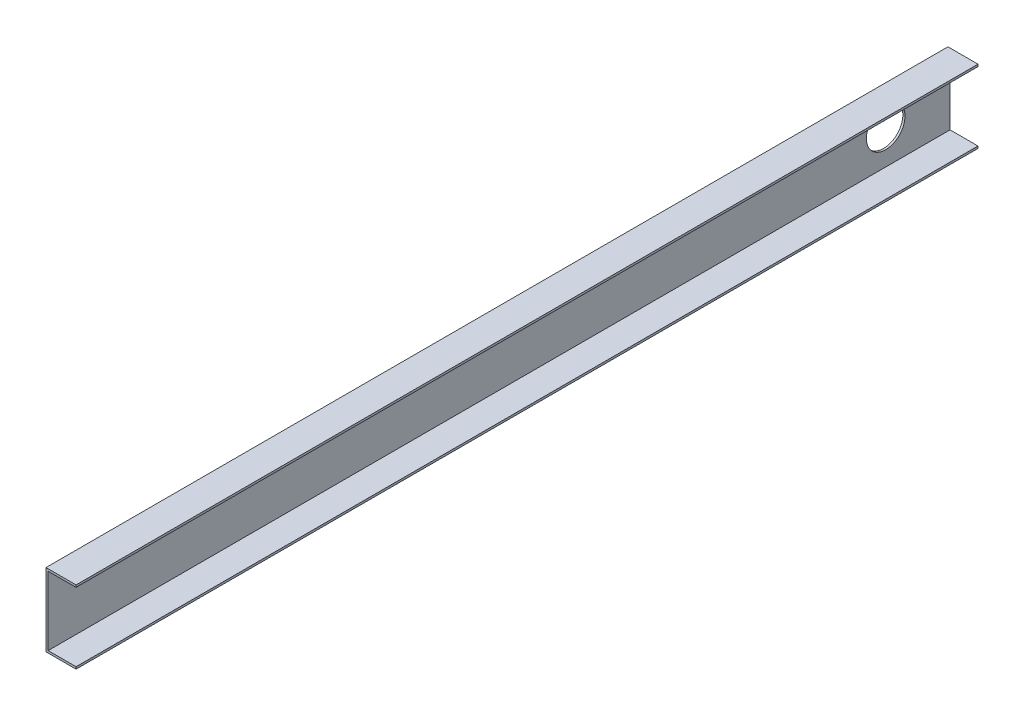
ISO-10303-21;
HEADER;
FILE_DESCRIPTION(('STEP AP214'),'2;1');
FILE_NAME('part.step','',(''),(''),'','','');
FILE_SCHEMA(('AUTOMOTIVE_DESIGN { 1 0 10303 214 1 1 1 1 }'));
ENDSEC;
DATA;
#1=APPLICATION_CONTEXT('core data for automotive mechanical design processes');
#2=APPLICATION_PROTOCOL_DEFINITION('international standard','automotive_design',2000,#1);
#3=PRODUCT_CONTEXT('',#1,'mechanical');
#4=PRODUCT('Part','Part','',(#3));
#5=PRODUCT_RELATED_PRODUCT_CATEGORY('part','',(#4));
#6=PRODUCT_DEFINITION_FORMATION('','',#4);
#7=PRODUCT_DEFINITION_CONTEXT('part definition',#1,'design');
#8=PRODUCT_DEFINITION('design','',#6,#7);
#9=PRODUCT_DEFINITION_SHAPE('','',#8);
#10=(LENGTH_UNIT() NAMED_UNIT(*) SI_UNIT(.MILLI.,.METRE.));
#11=(NAMED_UNIT(*) PLANE_ANGLE_UNIT() SI_UNIT($,.RADIAN.));
#12=(NAMED_UNIT(*) SI_UNIT($,.STERADIAN.) SOLID_ANGLE_UNIT());
#13=UNCERTAINTY_MEASURE_WITH_UNIT(LENGTH_MEASURE(1.E-05),#10,'distance_accuracy_value','');
#14=(GEOMETRIC_REPRESENTATION_CONTEXT(3) GLOBAL_UNCERTAINTY_ASSIGNED_CONTEXT((#13)) GLOBAL_UNIT_ASSIGNED_CONTEXT((#10,
#11,#12)) REPRESENTATION_CONTEXT('',''));
#15=CARTESIAN_POINT('',(0.,0.,0.));
#16=DIRECTION('',(0.,0.,1.));
#17=DIRECTION('',(1.,0.,0.));
#18=AXIS2_PLACEMENT_3D('',#15,#16,#17);
#19=CARTESIAN_POINT('',(0.5,-8.,210.));
#20=DIRECTION('',(-1.,0.,0.));
#21=DIRECTION('',(0.,0.,1.));
#22=AXIS2_PLACEMENT_3D('',#19,#20,#21);
#23=PLANE('',#22);
#24=CARTESIAN_POINT('',(0.5,0.,15.));
#25=DIRECTION('',(-1.,0.,0.));
#26=DIRECTION('',(0.,0.,1.));
#27=AXIS2_PLACEMENT_3D('',#24,#25,#26);
#28=CIRCLE('',#27,4.5);
#29=CARTESIAN_POINT('',(0.5,0.,19.5));
#30=VERTEX_POINT('',#29);
#31=EDGE_CURVE('E136',#30,#30,#28,.T.);
#32=ORIENTED_EDGE('',*,*,#31,.T.);
#33=EDGE_LOOP('',(#32));
#34=FACE_BOUND('',#33,.T.);
#35=DIRECTION('',(0.,1.,0.));
#36=VECTOR('',#35,1.);
#37=CARTESIAN_POINT('',(0.5,-8.,0.));
#38=LINE('',#37,#36);
#39=CARTESIAN_POINT('',(0.5,-8.,0.));
#40=VERTEX_POINT('',#39);
#41=CARTESIAN_POINT('',(0.5,8.,0.));
#42=VERTEX_POINT('',#41);
#43=EDGE_CURVE('E132',#40,#42,#38,.T.);
#44=ORIENTED_EDGE('',*,*,#43,.T.);
#45=DIRECTION('',(0.,0.,-1.));
#46=VECTOR('',#45,1.);
#47=CARTESIAN_POINT('',(0.5,8.,210.));
#48=LINE('',#47,#46);
#49=CARTESIAN_POINT('',(0.5,8.,210.));
#50=VERTEX_POINT('',#49);
#51=EDGE_CURVE('E11',#50,#42,#48,.T.);
#52=ORIENTED_EDGE('',*,*,#51,.F.);
#53=DIRECTION('',(0.,1.,0.));
#54=VECTOR('',#53,1.);
#55=CARTESIAN_POINT('',(0.5,-8.,210.));
#56=LINE('',#55,#54);
#57=CARTESIAN_POINT('',(0.5,-8.,210.));
#58=VERTEX_POINT('',#57);
#59=EDGE_CURVE('E147',#58,#50,#56,.T.);
#60=ORIENTED_EDGE('',*,*,#59,.F.);
#61=DIRECTION('',(0.,0.,-1.));
#62=VECTOR('',#61,1.);
#63=CARTESIAN_POINT('',(0.5,-8.,210.));
#64=LINE('',#63,#62);
#65=EDGE_CURVE('E128',#58,#40,#64,.T.);
#66=ORIENTED_EDGE('',*,*,#65,.T.);
#67=EDGE_LOOP('',(#44,#52,#60,#66));
#68=FACE_BOUND('',#67,.T.);
#69=ADVANCED_FACE('F36',(#34,#68),#23,.F.);
#70=CARTESIAN_POINT('',(0.5,8.,210.));
#71=DIRECTION('',(0.,1.,0.));
#72=DIRECTION('',(0.,0.,1.));
#73=AXIS2_PLACEMENT_3D('',#70,#71,#72);
#74=PLANE('',#73);
#75=DIRECTION('',(1.,0.,0.));
#76=VECTOR('',#75,1.);
#77=CARTESIAN_POINT('',(0.5,8.,0.));
#78=LINE('',#77,#76);
#79=CARTESIAN_POINT('',(7.,8.,0.));
#80=VERTEX_POINT('',#79);
#81=EDGE_CURVE('E135',#42,#80,#78,.T.);
#82=ORIENTED_EDGE('',*,*,#81,.T.);
#83=DIRECTION('',(0.,0.,-1.));
#84=VECTOR('',#83,1.);
#85=CARTESIAN_POINT('',(7.,8.,210.));
#86=LINE('',#85,#84);
#87=CARTESIAN_POINT('',(7.,8.,210.));
#88=VERTEX_POINT('',#87);
#89=EDGE_CURVE('E44',#88,#80,#86,.T.);
#90=ORIENTED_EDGE('',*,*,#89,.F.);
#91=DIRECTION('',(1.,0.,0.));
#92=VECTOR('',#91,1.);
#93=CARTESIAN_POINT('',(0.5,8.,210.));
#94=LINE('',#93,#92);
#95=EDGE_CURVE('E95',#50,#88,#94,.T.);
#96=ORIENTED_EDGE('',*,*,#95,.F.);
#97=ORIENTED_EDGE('',*,*,#51,.T.);
#98=EDGE_LOOP('',(#82,#90,#96,#97));
#99=FACE_BOUND('',#98,.T.);
#100=ADVANCED_FACE('F198',(#99),#74,.F.);
#101=CARTESIAN_POINT('',(7.,8.5,210.));
#102=DIRECTION('',(-1.,0.,0.));
#103=DIRECTION('',(0.,0.,1.));
#104=AXIS2_PLACEMENT_3D('',#101,#102,#103);
#105=PLANE('',#104);
#106=DIRECTION('',(0.,1.,0.));
#107=VECTOR('',#106,1.);
#108=CARTESIAN_POINT('',(7.,8.5,0.));
#109=LINE('',#108,#107);
#110=CARTESIAN_POINT('',(7.,8.5,0.));
#111=VERTEX_POINT('',#110);
#112=EDGE_CURVE('E138',#80,#111,#109,.T.);
#113=ORIENTED_EDGE('',*,*,#112,.T.);
#114=DIRECTION('',(0.,0.,-1.));
#115=VECTOR('',#114,1.);
#116=CARTESIAN_POINT('',(7.,8.5,210.));
#117=LINE('',#116,#115);
#118=CARTESIAN_POINT('',(7.,8.5,210.));
#119=VERTEX_POINT('',#118);
#120=EDGE_CURVE('E154',#119,#111,#117,.T.);
#121=ORIENTED_EDGE('',*,*,#120,.F.);
#122=DIRECTION('',(0.,1.,0.));
#123=VECTOR('',#122,1.);
#124=CARTESIAN_POINT('',(7.,8.5,210.));
#125=LINE('',#124,#123);
#126=EDGE_CURVE('E162',#88,#119,#125,.T.);
#127=ORIENTED_EDGE('',*,*,#126,.F.);
#128=ORIENTED_EDGE('',*,*,#89,.T.);
#129=EDGE_LOOP('',(#113,#121,#127,#128));
#130=FACE_BOUND('',#129,.T.);
#131=ADVANCED_FACE('F160',(#130),#105,.F.);
#132=CARTESIAN_POINT('',(0.,8.5,210.));
#133=DIRECTION('',(0.,-1.,0.));
#134=DIRECTION('',(1.,0.,0.));
#135=AXIS2_PLACEMENT_3D('',#132,#133,#134);
#136=PLANE('',#135);
#137=DIRECTION('',(-1.,0.,0.));
#138=VECTOR('',#137,1.);
#139=CARTESIAN_POINT('',(0.,8.5,0.));
#140=LINE('',#139,#138);
#141=CARTESIAN_POINT('',(0.,8.5,0.));
#142=VERTEX_POINT('',#141);
#143=EDGE_CURVE('E140',#111,#142,#140,.T.);
#144=ORIENTED_EDGE('',*,*,#143,.T.);
#145=DIRECTION('',(0.,0.,-1.));
#146=VECTOR('',#145,1.);
#147=CARTESIAN_POINT('',(0.,8.5,210.));
#148=LINE('',#147,#146);
#149=CARTESIAN_POINT('',(0.,8.5,210.));
#150=VERTEX_POINT('',#149);
#151=EDGE_CURVE('E151',#150,#142,#148,.T.);
#152=ORIENTED_EDGE('',*,*,#151,.F.);
#153=DIRECTION('',(-1.,0.,0.));
#154=VECTOR('',#153,1.);
#155=CARTESIAN_POINT('',(0.,8.5,210.));
#156=LINE('',#155,#154);
#157=EDGE_CURVE('E174',#119,#150,#156,.T.);
#158=ORIENTED_EDGE('',*,*,#157,.F.);
#159=ORIENTED_EDGE('',*,*,#120,.T.);
#160=EDGE_LOOP('',(#144,#152,#158,#159));
#161=FACE_BOUND('',#160,.T.);
#162=ADVANCED_FACE('F170',(#161),#136,.F.);
#163=CARTESIAN_POINT('',(0.,-8.5,210.));
#164=DIRECTION('',(1.,0.,0.));
#165=DIRECTION('',(0.,0.,-1.));
#166=AXIS2_PLACEMENT_3D('',#163,#164,#165);
#167=PLANE('',#166);
#168=CARTESIAN_POINT('',(0.,0.,15.));
#169=DIRECTION('',(-1.,0.,0.));
#170=DIRECTION('',(0.,0.,1.));
#171=AXIS2_PLACEMENT_3D('',#168,#169,#170);
#172=CIRCLE('',#171,4.5);
#173=CARTESIAN_POINT('',(0.,0.,19.5));
#174=VERTEX_POINT('',#173);
#175=EDGE_CURVE('E182',#174,#174,#172,.T.);
#176=ORIENTED_EDGE('',*,*,#175,.F.);
#177=EDGE_LOOP('',(#176));
#178=FACE_BOUND('',#177,.T.);
#179=DIRECTION('',(0.,-1.,0.));
#180=VECTOR('',#179,1.);
#181=CARTESIAN_POINT('',(0.,-8.5,0.));
#182=LINE('',#181,#180);
#183=CARTESIAN_POINT('',(0.,-8.5,0.));
#184=VERTEX_POINT('',#183);
#185=EDGE_CURVE('E142',#142,#184,#182,.T.);
#186=ORIENTED_EDGE('',*,*,#185,.T.);
#187=DIRECTION('',(0.,0.,-1.));
#188=VECTOR('',#187,1.);
#189=CARTESIAN_POINT('',(0.,-8.5,210.));
#190=LINE('',#189,#188);
#191=CARTESIAN_POINT('',(0.,-8.5,210.));
#192=VERTEX_POINT('',#191);
#193=EDGE_CURVE('E123',#192,#184,#190,.T.);
#194=ORIENTED_EDGE('',*,*,#193,.F.);
#195=DIRECTION('',(0.,-1.,0.));
#196=VECTOR('',#195,1.);
#197=CARTESIAN_POINT('',(0.,-8.5,210.));
#198=LINE('',#197,#196);
#199=EDGE_CURVE('E114',#150,#192,#198,.T.);
#200=ORIENTED_EDGE('',*,*,#199,.F.);
#201=ORIENTED_EDGE('',*,*,#151,.T.);
#202=EDGE_LOOP('',(#186,#194,#200,#201));
#203=FACE_BOUND('',#202,.T.);
#204=ADVANCED_FACE('F173',(#178,#203),#167,.F.);
#205=CARTESIAN_POINT('',(0.,-8.5,210.));
#206=DIRECTION('',(0.,1.,0.));
#207=DIRECTION('',(0.,0.,1.));
#208=AXIS2_PLACEMENT_3D('',#205,#206,#207);
#209=PLANE('',#208);
#210=DIRECTION('',(1.,0.,0.));
#211=VECTOR('',#210,1.);
#212=CARTESIAN_POINT('',(0.,-8.5,0.));
#213=LINE('',#212,#211);
#214=CARTESIAN_POINT('',(7.,-8.5,0.));
#215=VERTEX_POINT('',#214);
#216=EDGE_CURVE('E122',#184,#215,#213,.T.);
#217=ORIENTED_EDGE('',*,*,#216,.T.);
#218=DIRECTION('',(0.,0.,-1.));
#219=VECTOR('',#218,1.);
#220=CARTESIAN_POINT('',(7.,-8.5,210.));
#221=LINE('',#220,#219);
#222=CARTESIAN_POINT('',(7.,-8.5,210.));
#223=VERTEX_POINT('',#222);
#224=EDGE_CURVE('E119',#223,#215,#221,.T.);
#225=ORIENTED_EDGE('',*,*,#224,.F.);
#226=DIRECTION('',(1.,0.,0.));
#227=VECTOR('',#226,1.);
#228=CARTESIAN_POINT('',(0.,-8.5,210.));
#229=LINE('',#228,#227);
#230=EDGE_CURVE('E108',#192,#223,#229,.T.);
#231=ORIENTED_EDGE('',*,*,#230,.F.);
#232=ORIENTED_EDGE('',*,*,#193,.T.);
#233=EDGE_LOOP('',(#217,#225,#231,#232));
#234=FACE_BOUND('',#233,.T.);
#235=ADVANCED_FACE('F120',(#234),#209,.F.);
#236=CARTESIAN_POINT('',(7.,-8.5,210.));
#237=DIRECTION('',(-1.,0.,0.));
#238=DIRECTION('',(0.,0.,1.));
#239=AXIS2_PLACEMENT_3D('',#236,#237,#238);
#240=PLANE('',#239);
#241=DIRECTION('',(0.,1.,0.));
#242=VECTOR('',#241,1.);
#243=CARTESIAN_POINT('',(7.,-8.5,0.));
#244=LINE('',#243,#242);
#245=CARTESIAN_POINT('',(7.,-8.,0.));
#246=VERTEX_POINT('',#245);
#247=EDGE_CURVE('E81',#215,#246,#244,.T.);
#248=ORIENTED_EDGE('',*,*,#247,.T.);
#249=DIRECTION('',(0.,0.,-1.));
#250=VECTOR('',#249,1.);
#251=CARTESIAN_POINT('',(7.,-8.,210.));
#252=LINE('',#251,#250);
#253=CARTESIAN_POINT('',(7.,-8.,210.));
#254=VERTEX_POINT('',#253);
#255=EDGE_CURVE('E124',#254,#246,#252,.T.);
#256=ORIENTED_EDGE('',*,*,#255,.F.);
#257=DIRECTION('',(0.,1.,0.));
#258=VECTOR('',#257,1.);
#259=CARTESIAN_POINT('',(7.,-8.5,210.));
#260=LINE('',#259,#258);
#261=EDGE_CURVE('E112',#223,#254,#260,.T.);
#262=ORIENTED_EDGE('',*,*,#261,.F.);
#263=ORIENTED_EDGE('',*,*,#224,.T.);
#264=EDGE_LOOP('',(#248,#256,#262,#263));
#265=FACE_BOUND('',#264,.T.);
#266=ADVANCED_FACE('F126',(#265),#240,.F.);
#267=CARTESIAN_POINT('',(0.5,-8.,210.));
#268=DIRECTION('',(0.,-1.,0.));
#269=DIRECTION('',(0.,0.,-1.));
#270=AXIS2_PLACEMENT_3D('',#267,#268,#269);
#271=PLANE('',#270);
#272=DIRECTION('',(-1.,0.,0.));
#273=VECTOR('',#272,1.);
#274=CARTESIAN_POINT('',(0.5,-8.,0.));
#275=LINE('',#274,#273);
#276=EDGE_CURVE('E87',#246,#40,#275,.T.);
#277=ORIENTED_EDGE('',*,*,#276,.T.);
#278=ORIENTED_EDGE('',*,*,#65,.F.);
#279=DIRECTION('',(-1.,0.,0.));
#280=VECTOR('',#279,1.);
#281=CARTESIAN_POINT('',(0.5,-8.,210.));
#282=LINE('',#281,#280);
#283=EDGE_CURVE('E52',#254,#58,#282,.T.);
#284=ORIENTED_EDGE('',*,*,#283,.F.);
#285=ORIENTED_EDGE('',*,*,#255,.T.);
#286=EDGE_LOOP('',(#277,#278,#284,#285));
#287=FACE_BOUND('',#286,.T.);
#288=ADVANCED_FACE('F207',(#287),#271,.F.);
#289=CARTESIAN_POINT('',(0.,0.,210.));
#290=DIRECTION('',(0.,0.,-1.));
#291=DIRECTION('',(-1.,0.,0.));
#292=AXIS2_PLACEMENT_3D('',#289,#290,#291);
#293=PLANE('',#292);
#294=ORIENTED_EDGE('',*,*,#59,.T.);
#295=ORIENTED_EDGE('',*,*,#95,.T.);
#296=ORIENTED_EDGE('',*,*,#126,.T.);
#297=ORIENTED_EDGE('',*,*,#157,.T.);
#298=ORIENTED_EDGE('',*,*,#199,.T.);
#299=ORIENTED_EDGE('',*,*,#230,.T.);
#300=ORIENTED_EDGE('',*,*,#261,.T.);
#301=ORIENTED_EDGE('',*,*,#283,.T.);
#302=EDGE_LOOP('',(#294,#295,#296,#297,#298,#299,#300,#301));
#303=FACE_BOUND('',#302,.T.);
#304=ADVANCED_FACE('F110',(#303),#293,.F.);
#305=CARTESIAN_POINT('',(0.,0.,0.));
#306=DIRECTION('',(0.,0.,-1.));
#307=DIRECTION('',(-1.,0.,0.));
#308=AXIS2_PLACEMENT_3D('',#305,#306,#307);
#309=PLANE('',#308);
#310=ORIENTED_EDGE('',*,*,#43,.F.);
#311=ORIENTED_EDGE('',*,*,#276,.F.);
#312=ORIENTED_EDGE('',*,*,#247,.F.);
#313=ORIENTED_EDGE('',*,*,#216,.F.);
#314=ORIENTED_EDGE('',*,*,#185,.F.);
#315=ORIENTED_EDGE('',*,*,#143,.F.);
#316=ORIENTED_EDGE('',*,*,#112,.F.);
#317=ORIENTED_EDGE('',*,*,#81,.F.);
#318=EDGE_LOOP('',(#310,#311,#312,#313,#314,#315,#316,#317));
#319=FACE_BOUND('',#318,.T.);
#320=ADVANCED_FACE('F166',(#319),#309,.T.);
#321=CARTESIAN_POINT('',(10.,0.,15.));
#322=DIRECTION('',(-1.,0.,0.));
#323=DIRECTION('',(0.,0.,1.));
#324=AXIS2_PLACEMENT_3D('',#321,#322,#323);
#325=CYLINDRICAL_SURFACE('',#324,4.5);
#326=ORIENTED_EDGE('',*,*,#175,.T.);
#327=EDGE_LOOP('',(#326));
#328=FACE_BOUND('',#327,.T.);
#329=ORIENTED_EDGE('',*,*,#31,.F.);
#330=EDGE_LOOP('',(#329));
#331=FACE_BOUND('',#330,.T.);
#332=ADVANCED_FACE('F186',(#328,#331),#325,.F.);
#333=CLOSED_SHELL('',(#69,#100,#131,#162,#204,#235,#266,#288,#304,#320,#332));
#334=MANIFOLD_SOLID_BREP('B2',#333);
#335=ADVANCED_BREP_SHAPE_REPRESENTATION('',(#18,#334),#14);
#336=SHAPE_DEFINITION_REPRESENTATION(#9,#335);
ENDSEC;
END-ISO-10303-21;
